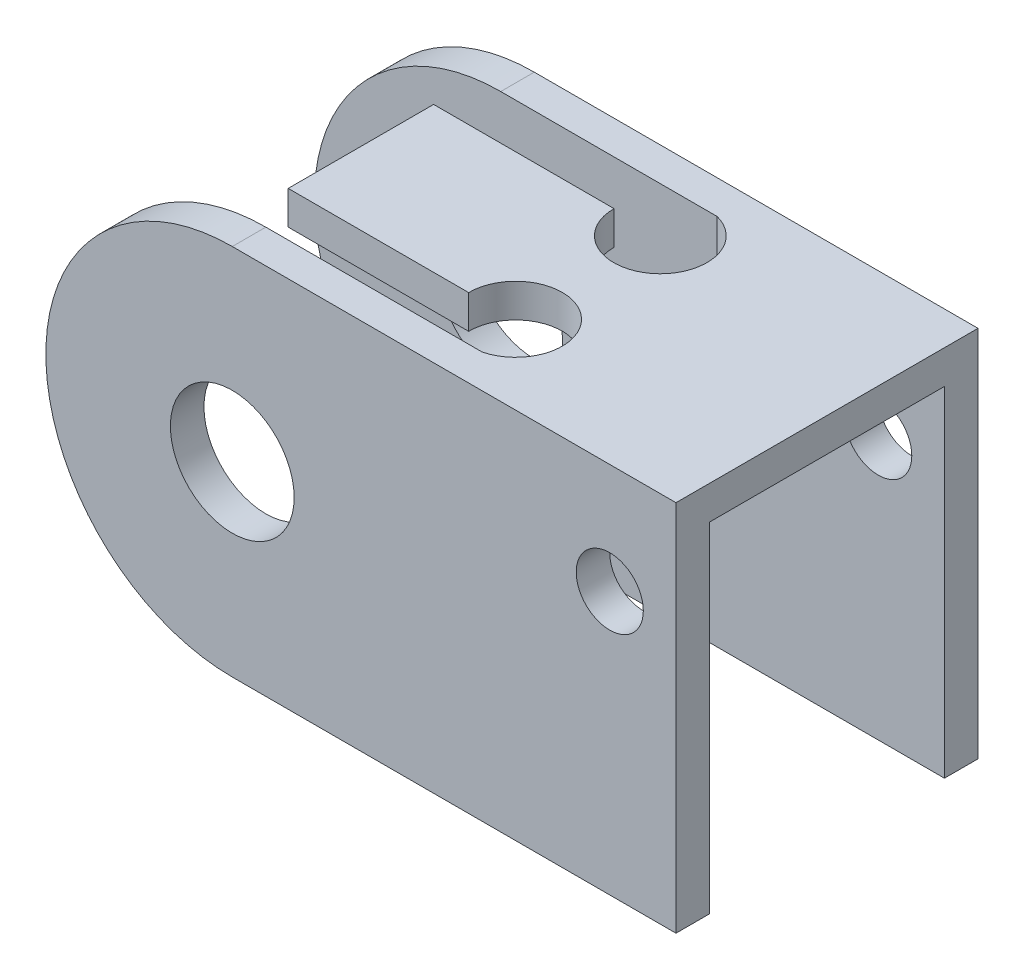
ISO-10303-21;
HEADER;
FILE_DESCRIPTION(('STEP AP214'),'2;1');
FILE_NAME('part.step','',(''),(''),'','','');
FILE_SCHEMA(('AUTOMOTIVE_DESIGN { 1 0 10303 214 1 1 1 1 }'));
ENDSEC;
DATA;
#1=APPLICATION_CONTEXT('core data for automotive mechanical design processes');
#2=APPLICATION_PROTOCOL_DEFINITION('international standard','automotive_design',2000,#1);
#3=PRODUCT_CONTEXT('',#1,'mechanical');
#4=PRODUCT('Part','Part','',(#3));
#5=PRODUCT_RELATED_PRODUCT_CATEGORY('part','',(#4));
#6=PRODUCT_DEFINITION_FORMATION('','',#4);
#7=PRODUCT_DEFINITION_CONTEXT('part definition',#1,'design');
#8=PRODUCT_DEFINITION('design','',#6,#7);
#9=PRODUCT_DEFINITION_SHAPE('','',#8);
#10=(LENGTH_UNIT() NAMED_UNIT(*) SI_UNIT(.MILLI.,.METRE.));
#11=(NAMED_UNIT(*) PLANE_ANGLE_UNIT() SI_UNIT($,.RADIAN.));
#12=(NAMED_UNIT(*) SI_UNIT($,.STERADIAN.) SOLID_ANGLE_UNIT());
#13=UNCERTAINTY_MEASURE_WITH_UNIT(LENGTH_MEASURE(1.E-05),#10,'distance_accuracy_value','');
#14=(GEOMETRIC_REPRESENTATION_CONTEXT(3) GLOBAL_UNCERTAINTY_ASSIGNED_CONTEXT((#13)) GLOBAL_UNIT_ASSIGNED_CONTEXT((#10,
#11,#12)) REPRESENTATION_CONTEXT('',''));
#15=CARTESIAN_POINT('',(0.,0.,0.));
#16=DIRECTION('',(0.,0.,1.));
#17=DIRECTION('',(1.,0.,0.));
#18=AXIS2_PLACEMENT_3D('',#15,#16,#17);
#19=CARTESIAN_POINT('',(-11.0363,-5.207,-5.1435));
#20=DIRECTION('',(0.,0.,-1.));
#21=DIRECTION('',(-1.,0.,0.));
#22=AXIS2_PLACEMENT_3D('',#19,#20,#21);
#23=CYLINDRICAL_SURFACE('',#22,6.35);
#24=DIRECTION('',(0.,0.,1.));
#25=VECTOR('',#24,1.);
#26=CARTESIAN_POINT('',(-11.0363,1.143,-5.1435));
#27=LINE('',#26,#25);
#28=CARTESIAN_POINT('',(-11.0363,1.143,-5.1435));
#29=VERTEX_POINT('',#28);
#30=CARTESIAN_POINT('',(-11.0363,1.143,-4.0005));
#31=VERTEX_POINT('',#30);
#32=EDGE_CURVE('E257',#29,#31,#27,.T.);
#33=ORIENTED_EDGE('',*,*,#32,.F.);
#34=CARTESIAN_POINT('',(-11.0363,-5.207,-5.1435));
#35=DIRECTION('',(0.,0.,1.));
#36=DIRECTION('',(1.,0.,0.));
#37=AXIS2_PLACEMENT_3D('',#34,#35,#36);
#38=CIRCLE('',#37,6.35);
#39=CARTESIAN_POINT('',(-11.0363,-11.557,-5.1435));
#40=VERTEX_POINT('',#39);
#41=EDGE_CURVE('E45',#40,#29,#38,.F.);
#42=ORIENTED_EDGE('',*,*,#41,.F.);
#43=DIRECTION('',(0.,0.,-1.));
#44=VECTOR('',#43,1.);
#45=CARTESIAN_POINT('',(-11.0363,-11.557,-4.0005));
#46=LINE('',#45,#44);
#47=CARTESIAN_POINT('',(-11.0363,-11.557,-4.0005));
#48=VERTEX_POINT('',#47);
#49=EDGE_CURVE('E260',#48,#40,#46,.T.);
#50=ORIENTED_EDGE('',*,*,#49,.F.);
#51=CARTESIAN_POINT('',(-11.0363,-5.207,-4.0005));
#52=DIRECTION('',(0.,0.,1.));
#53=DIRECTION('',(1.,0.,0.));
#54=AXIS2_PLACEMENT_3D('',#51,#52,#53);
#55=CIRCLE('',#54,6.35);
#56=EDGE_CURVE('E11',#31,#48,#55,.T.);
#57=ORIENTED_EDGE('',*,*,#56,.F.);
#58=EDGE_LOOP('',(#33,#42,#50,#57));
#59=FACE_BOUND('',#58,.T.);
#60=ADVANCED_FACE('F37',(#59),#23,.T.);
#61=CARTESIAN_POINT('',(-11.0363,-5.207,4.0005));
#62=DIRECTION('',(0.,0.,1.));
#63=DIRECTION('',(1.,0.,0.));
#64=AXIS2_PLACEMENT_3D('',#61,#62,#63);
#65=CYLINDRICAL_SURFACE('',#64,6.35);
#66=DIRECTION('',(0.,0.,1.));
#67=VECTOR('',#66,1.);
#68=CARTESIAN_POINT('',(-11.0363,1.143,0.));
#69=LINE('',#68,#67);
#70=CARTESIAN_POINT('',(-11.0363,1.143,4.0005));
#71=VERTEX_POINT('',#70);
#72=CARTESIAN_POINT('',(-11.0363,1.143,5.1435));
#73=VERTEX_POINT('',#72);
#74=EDGE_CURVE('E242',#71,#73,#69,.T.);
#75=ORIENTED_EDGE('',*,*,#74,.F.);
#76=CARTESIAN_POINT('',(-11.0363,-5.207,4.0005));
#77=DIRECTION('',(0.,0.,-1.));
#78=DIRECTION('',(-1.,0.,0.));
#79=AXIS2_PLACEMENT_3D('',#76,#77,#78);
#80=CIRCLE('',#79,6.35);
#81=CARTESIAN_POINT('',(-11.0363,-11.557,4.0005));
#82=VERTEX_POINT('',#81);
#83=EDGE_CURVE('E248',#82,#71,#80,.T.);
#84=ORIENTED_EDGE('',*,*,#83,.F.);
#85=DIRECTION('',(0.,0.,1.));
#86=VECTOR('',#85,1.);
#87=CARTESIAN_POINT('',(-11.0363,-11.557,4.0005));
#88=LINE('',#87,#86);
#89=CARTESIAN_POINT('',(-11.0363,-11.557,5.1435));
#90=VERTEX_POINT('',#89);
#91=EDGE_CURVE('E245',#90,#82,#88,.F.);
#92=ORIENTED_EDGE('',*,*,#91,.F.);
#93=CARTESIAN_POINT('',(-11.0363,-5.207,5.1435));
#94=DIRECTION('',(0.,0.,-1.));
#95=DIRECTION('',(-1.,0.,0.));
#96=AXIS2_PLACEMENT_3D('',#93,#94,#95);
#97=CIRCLE('',#96,6.35);
#98=EDGE_CURVE('E250',#73,#90,#97,.F.);
#99=ORIENTED_EDGE('',*,*,#98,.F.);
#100=EDGE_LOOP('',(#75,#84,#92,#99));
#101=FACE_BOUND('',#100,.T.);
#102=ADVANCED_FACE('F315',(#101),#65,.T.);
#103=CARTESIAN_POINT('',(4.0767,1.143,-5.1435));
#104=DIRECTION('',(-1.,0.,0.));
#105=DIRECTION('',(0.,0.,1.));
#106=AXIS2_PLACEMENT_3D('',#103,#104,#105);
#107=PLANE('',#106);
#108=DIRECTION('',(0.,0.,-1.));
#109=VECTOR('',#108,1.);
#110=CARTESIAN_POINT('',(4.0767,0.,-5.1435));
#111=LINE('',#110,#109);
#112=CARTESIAN_POINT('',(4.0767,0.,4.0005));
#113=VERTEX_POINT('',#112);
#114=CARTESIAN_POINT('',(4.0767,0.,-4.0005));
#115=VERTEX_POINT('',#114);
#116=EDGE_CURVE('E156',#113,#115,#111,.T.);
#117=ORIENTED_EDGE('',*,*,#116,.T.);
#118=DIRECTION('',(0.,1.,0.));
#119=VECTOR('',#118,1.);
#120=CARTESIAN_POINT('',(4.0767,1.143,-4.0005));
#121=LINE('',#120,#119);
#122=CARTESIAN_POINT('',(4.0767,-11.557,-4.0005));
#123=VERTEX_POINT('',#122);
#124=EDGE_CURVE('E137',#123,#115,#121,.T.);
#125=ORIENTED_EDGE('',*,*,#124,.F.);
#126=DIRECTION('',(0.,0.,-1.));
#127=VECTOR('',#126,1.);
#128=CARTESIAN_POINT('',(4.0767,-11.557,-4.0005));
#129=LINE('',#128,#127);
#130=CARTESIAN_POINT('',(4.0767,-11.557,-5.1435));
#131=VERTEX_POINT('',#130);
#132=EDGE_CURVE('E143',#123,#131,#129,.T.);
#133=ORIENTED_EDGE('',*,*,#132,.T.);
#134=DIRECTION('',(0.,-1.,0.));
#135=VECTOR('',#134,1.);
#136=CARTESIAN_POINT('',(4.0767,1.143,-5.1435));
#137=LINE('',#136,#135);
#138=CARTESIAN_POINT('',(4.0767,1.143,-5.1435));
#139=VERTEX_POINT('',#138);
#140=EDGE_CURVE('E237',#139,#131,#137,.T.);
#141=ORIENTED_EDGE('',*,*,#140,.F.);
#142=DIRECTION('',(0.,0.,-1.));
#143=VECTOR('',#142,1.);
#144=CARTESIAN_POINT('',(4.0767,1.143,-5.1435));
#145=LINE('',#144,#143);
#146=CARTESIAN_POINT('',(4.0767,1.143,5.1435));
#147=VERTEX_POINT('',#146);
#148=EDGE_CURVE('E226',#147,#139,#145,.T.);
#149=ORIENTED_EDGE('',*,*,#148,.F.);
#150=DIRECTION('',(0.,-1.,0.));
#151=VECTOR('',#150,1.);
#152=CARTESIAN_POINT('',(4.0767,1.143,5.1435));
#153=LINE('',#152,#151);
#154=CARTESIAN_POINT('',(4.0767,-11.557,5.1435));
#155=VERTEX_POINT('',#154);
#156=EDGE_CURVE('E233',#147,#155,#153,.T.);
#157=ORIENTED_EDGE('',*,*,#156,.T.);
#158=DIRECTION('',(0.,0.,1.));
#159=VECTOR('',#158,1.);
#160=CARTESIAN_POINT('',(4.0767,-11.557,4.0005));
#161=LINE('',#160,#159);
#162=CARTESIAN_POINT('',(4.0767,-11.557,4.0005));
#163=VERTEX_POINT('',#162);
#164=EDGE_CURVE('E183',#163,#155,#161,.T.);
#165=ORIENTED_EDGE('',*,*,#164,.F.);
#166=DIRECTION('',(0.,1.,0.));
#167=VECTOR('',#166,1.);
#168=CARTESIAN_POINT('',(4.0767,1.143,4.0005));
#169=LINE('',#168,#167);
#170=EDGE_CURVE('E175',#163,#113,#169,.T.);
#171=ORIENTED_EDGE('',*,*,#170,.T.);
#172=EDGE_LOOP('',(#117,#125,#133,#141,#149,#157,#165,#171));
#173=FACE_BOUND('',#172,.T.);
#174=ADVANCED_FACE('F153',(#173),#107,.F.);
#175=CARTESIAN_POINT('',(-4.0767,1.143,-5.1435));
#176=DIRECTION('',(0.,0.,1.));
#177=DIRECTION('',(1.,0.,0.));
#178=AXIS2_PLACEMENT_3D('',#175,#176,#177);
#179=PLANE('',#178);
#180=CARTESIAN_POINT('',(1.82121981781893,-2.60202754234179,-5.1435));
#181=DIRECTION('',(0.,0.,1.));
#182=DIRECTION('',(1.,0.,0.));
#183=AXIS2_PLACEMENT_3D('',#180,#181,#182);
#184=CIRCLE('',#183,1.143);
#185=CARTESIAN_POINT('',(2.96421981781893,-2.60202754234179,-5.1435));
#186=VERTEX_POINT('',#185);
#187=EDGE_CURVE('E379',#186,#186,#184,.T.);
#188=ORIENTED_EDGE('',*,*,#187,.T.);
#189=EDGE_LOOP('',(#188));
#190=FACE_BOUND('',#189,.T.);
#191=CARTESIAN_POINT('',(-11.0363,-5.207,-5.1435));
#192=DIRECTION('',(0.,0.,-1.));
#193=DIRECTION('',(-1.,0.,0.));
#194=AXIS2_PLACEMENT_3D('',#191,#192,#193);
#195=CIRCLE('',#194,2.1082);
#196=CARTESIAN_POINT('',(-13.1445,-5.207,-5.1435));
#197=VERTEX_POINT('',#196);
#198=EDGE_CURVE('E381',#197,#197,#195,.T.);
#199=ORIENTED_EDGE('',*,*,#198,.F.);
#200=EDGE_LOOP('',(#199));
#201=FACE_BOUND('',#200,.T.);
#202=DIRECTION('',(1.,0.,0.));
#203=VECTOR('',#202,1.);
#204=CARTESIAN_POINT('',(4.0767,-11.557,-5.1435));
#205=LINE('',#204,#203);
#206=EDGE_CURVE('E146',#40,#131,#205,.T.);
#207=ORIENTED_EDGE('',*,*,#206,.F.);
#208=ORIENTED_EDGE('',*,*,#41,.T.);
#209=DIRECTION('',(-1.,0.,0.));
#210=VECTOR('',#209,1.);
#211=CARTESIAN_POINT('',(-4.0767,1.143,-5.1435));
#212=LINE('',#211,#210);
#213=EDGE_CURVE('E228',#139,#29,#212,.T.);
#214=ORIENTED_EDGE('',*,*,#213,.F.);
#215=ORIENTED_EDGE('',*,*,#140,.T.);
#216=EDGE_LOOP('',(#207,#208,#214,#215));
#217=FACE_BOUND('',#216,.T.);
#218=ADVANCED_FACE('F263',(#190,#201,#217),#179,.F.);
#219=CARTESIAN_POINT('',(-4.0767,1.143,5.1435));
#220=DIRECTION('',(0.,0.,-1.));
#221=DIRECTION('',(-1.,0.,0.));
#222=AXIS2_PLACEMENT_3D('',#219,#220,#221);
#223=PLANE('',#222);
#224=CARTESIAN_POINT('',(1.82121981781893,-2.60202754234179,5.1435));
#225=DIRECTION('',(0.,0.,1.));
#226=DIRECTION('',(1.,0.,0.));
#227=AXIS2_PLACEMENT_3D('',#224,#225,#226);
#228=CIRCLE('',#227,1.143);
#229=CARTESIAN_POINT('',(2.96421981781893,-2.60202754234179,5.1435));
#230=VERTEX_POINT('',#229);
#231=EDGE_CURVE('E165',#230,#230,#228,.T.);
#232=ORIENTED_EDGE('',*,*,#231,.F.);
#233=EDGE_LOOP('',(#232));
#234=FACE_BOUND('',#233,.T.);
#235=CARTESIAN_POINT('',(-11.0363,-5.207,5.1435));
#236=DIRECTION('',(0.,0.,1.));
#237=DIRECTION('',(1.,0.,0.));
#238=AXIS2_PLACEMENT_3D('',#235,#236,#237);
#239=CIRCLE('',#238,2.1082);
#240=CARTESIAN_POINT('',(-8.9281,-5.207,5.1435));
#241=VERTEX_POINT('',#240);
#242=EDGE_CURVE('E169',#241,#241,#239,.T.);
#243=ORIENTED_EDGE('',*,*,#242,.F.);
#244=EDGE_LOOP('',(#243));
#245=FACE_BOUND('',#244,.T.);
#246=DIRECTION('',(1.,0.,0.));
#247=VECTOR('',#246,1.);
#248=CARTESIAN_POINT('',(-4.0767,1.143,5.1435));
#249=LINE('',#248,#247);
#250=EDGE_CURVE('E231',#73,#147,#249,.T.);
#251=ORIENTED_EDGE('',*,*,#250,.F.);
#252=ORIENTED_EDGE('',*,*,#98,.T.);
#253=DIRECTION('',(1.,0.,0.));
#254=VECTOR('',#253,1.);
#255=CARTESIAN_POINT('',(4.0767,-11.557,5.1435));
#256=LINE('',#255,#254);
#257=EDGE_CURVE('E178',#90,#155,#256,.T.);
#258=ORIENTED_EDGE('',*,*,#257,.T.);
#259=ORIENTED_EDGE('',*,*,#156,.F.);
#260=EDGE_LOOP('',(#251,#252,#258,#259));
#261=FACE_BOUND('',#260,.T.);
#262=ADVANCED_FACE('F330',(#234,#245,#261),#223,.F.);
#263=CARTESIAN_POINT('',(0.,1.143,0.));
#264=DIRECTION('',(0.,1.,0.));
#265=DIRECTION('',(0.,0.,1.));
#266=AXIS2_PLACEMENT_3D('',#263,#264,#265);
#267=PLANE('',#266);
#268=ORIENTED_EDGE('',*,*,#213,.T.);
#269=ORIENTED_EDGE('',*,*,#32,.T.);
#270=DIRECTION('',(-1.,0.,0.));
#271=VECTOR('',#270,1.);
#272=CARTESIAN_POINT('',(4.0767,1.143,-4.0005));
#273=LINE('',#272,#271);
#274=CARTESIAN_POINT('',(-3.66547261184954,1.143,-4.0005));
#275=VERTEX_POINT('',#274);
#276=EDGE_CURVE('E140',#275,#31,#273,.T.);
#277=ORIENTED_EDGE('',*,*,#276,.F.);
#278=CARTESIAN_POINT('',(-4.0640503984127,1.143,-2.4638503984127));
#279=DIRECTION('',(0.,-1.,0.));
#280=DIRECTION('',(0.,0.,1.));
#281=AXIS2_PLACEMENT_3D('',#278,#279,#280);
#282=CIRCLE('',#281,1.5875);
#283=CARTESIAN_POINT('',(-5.6515,1.143,-2.4765));
#284=VERTEX_POINT('',#283);
#285=EDGE_CURVE('E200',#275,#284,#282,.T.);
#286=ORIENTED_EDGE('',*,*,#285,.T.);
#287=DIRECTION('',(-1.,0.,0.));
#288=VECTOR('',#287,1.);
#289=CARTESIAN_POINT('',(-11.7983,1.143,-2.4765));
#290=LINE('',#289,#288);
#291=CARTESIAN_POINT('',(-11.7983,1.143,-2.4765));
#292=VERTEX_POINT('',#291);
#293=EDGE_CURVE('E202',#284,#292,#290,.T.);
#294=ORIENTED_EDGE('',*,*,#293,.T.);
#295=DIRECTION('',(0.,0.,1.));
#296=VECTOR('',#295,1.);
#297=CARTESIAN_POINT('',(-11.7983,1.143,-2.4765));
#298=LINE('',#297,#296);
#299=CARTESIAN_POINT('',(-11.7983,1.143,2.4765));
#300=VERTEX_POINT('',#299);
#301=EDGE_CURVE('E191',#292,#300,#298,.T.);
#302=ORIENTED_EDGE('',*,*,#301,.T.);
#303=DIRECTION('',(1.,0.,0.));
#304=VECTOR('',#303,1.);
#305=CARTESIAN_POINT('',(-11.7983,1.143,2.4765));
#306=LINE('',#305,#304);
#307=CARTESIAN_POINT('',(-5.6515,1.143,2.4765));
#308=VERTEX_POINT('',#307);
#309=EDGE_CURVE('E194',#300,#308,#306,.T.);
#310=ORIENTED_EDGE('',*,*,#309,.T.);
#311=CARTESIAN_POINT('',(-4.06405039841269,1.143,2.4638503984127));
#312=DIRECTION('',(0.,-1.,0.));
#313=DIRECTION('',(0.,0.,1.));
#314=AXIS2_PLACEMENT_3D('',#311,#312,#313);
#315=CIRCLE('',#314,1.5875);
#316=CARTESIAN_POINT('',(-3.66547261184953,1.143,4.0005));
#317=VERTEX_POINT('',#316);
#318=EDGE_CURVE('E197',#308,#317,#315,.T.);
#319=ORIENTED_EDGE('',*,*,#318,.T.);
#320=DIRECTION('',(-1.,0.,0.));
#321=VECTOR('',#320,1.);
#322=CARTESIAN_POINT('',(4.0767,1.143,4.0005));
#323=LINE('',#322,#321);
#324=EDGE_CURVE('E177',#317,#71,#323,.T.);
#325=ORIENTED_EDGE('',*,*,#324,.T.);
#326=ORIENTED_EDGE('',*,*,#74,.T.);
#327=ORIENTED_EDGE('',*,*,#250,.T.);
#328=ORIENTED_EDGE('',*,*,#148,.T.);
#329=EDGE_LOOP('',(#268,#269,#277,#286,#294,#302,#310,#319,#325,#326,#327,#328));
#330=FACE_BOUND('',#329,.T.);
#331=ADVANCED_FACE('F266',(#330),#267,.T.);
#332=CARTESIAN_POINT('',(0.,0.,0.));
#333=DIRECTION('',(0.,1.,0.));
#334=DIRECTION('',(0.,0.,1.));
#335=AXIS2_PLACEMENT_3D('',#332,#333,#334);
#336=PLANE('',#335);
#337=CARTESIAN_POINT('',(-4.0640503984127,0.,-2.4638503984127));
#338=DIRECTION('',(0.,-1.,0.));
#339=DIRECTION('',(0.,0.,1.));
#340=AXIS2_PLACEMENT_3D('',#337,#338,#339);
#341=CIRCLE('',#340,1.5875);
#342=CARTESIAN_POINT('',(-3.66547261184954,0.,-4.0005));
#343=VERTEX_POINT('',#342);
#344=CARTESIAN_POINT('',(-5.6515,0.,-2.4765));
#345=VERTEX_POINT('',#344);
#346=EDGE_CURVE('E212',#343,#345,#341,.T.);
#347=ORIENTED_EDGE('',*,*,#346,.F.);
#348=DIRECTION('',(1.,0.,0.));
#349=VECTOR('',#348,1.);
#350=CARTESIAN_POINT('',(0.,0.,-4.0005));
#351=LINE('',#350,#349);
#352=EDGE_CURVE('E150',#343,#115,#351,.T.);
#353=ORIENTED_EDGE('',*,*,#352,.T.);
#354=ORIENTED_EDGE('',*,*,#116,.F.);
#355=DIRECTION('',(-1.,0.,0.));
#356=VECTOR('',#355,1.);
#357=CARTESIAN_POINT('',(0.,0.,4.0005));
#358=LINE('',#357,#356);
#359=CARTESIAN_POINT('',(-3.66547261184953,0.,4.0005));
#360=VERTEX_POINT('',#359);
#361=EDGE_CURVE('E187',#113,#360,#358,.T.);
#362=ORIENTED_EDGE('',*,*,#361,.T.);
#363=CARTESIAN_POINT('',(-4.06405039841269,0.,2.4638503984127));
#364=DIRECTION('',(0.,-1.,0.));
#365=DIRECTION('',(0.,0.,1.));
#366=AXIS2_PLACEMENT_3D('',#363,#364,#365);
#367=CIRCLE('',#366,1.5875);
#368=CARTESIAN_POINT('',(-5.6515,0.,2.4765));
#369=VERTEX_POINT('',#368);
#370=EDGE_CURVE('E209',#369,#360,#367,.T.);
#371=ORIENTED_EDGE('',*,*,#370,.F.);
#372=DIRECTION('',(1.,0.,0.));
#373=VECTOR('',#372,1.);
#374=CARTESIAN_POINT('',(-11.7983,0.,2.4765));
#375=LINE('',#374,#373);
#376=CARTESIAN_POINT('',(-11.7983,0.,2.4765));
#377=VERTEX_POINT('',#376);
#378=EDGE_CURVE('E207',#377,#369,#375,.T.);
#379=ORIENTED_EDGE('',*,*,#378,.F.);
#380=DIRECTION('',(0.,0.,1.));
#381=VECTOR('',#380,1.);
#382=CARTESIAN_POINT('',(-11.7983,0.,-2.4765));
#383=LINE('',#382,#381);
#384=CARTESIAN_POINT('',(-11.7983,0.,-2.4765));
#385=VERTEX_POINT('',#384);
#386=EDGE_CURVE('E190',#385,#377,#383,.T.);
#387=ORIENTED_EDGE('',*,*,#386,.F.);
#388=DIRECTION('',(-1.,0.,0.));
#389=VECTOR('',#388,1.);
#390=CARTESIAN_POINT('',(-11.7983,0.,-2.4765));
#391=LINE('',#390,#389);
#392=EDGE_CURVE('E195',#345,#385,#391,.T.);
#393=ORIENTED_EDGE('',*,*,#392,.F.);
#394=EDGE_LOOP('',(#347,#353,#354,#362,#371,#379,#387,#393));
#395=FACE_BOUND('',#394,.T.);
#396=ADVANCED_FACE('F283',(#395),#336,.F.);
#397=CARTESIAN_POINT('',(-4.06405039841269,1.143,2.4638503984127));
#398=DIRECTION('',(0.,-1.,0.));
#399=DIRECTION('',(0.,0.,-1.));
#400=AXIS2_PLACEMENT_3D('',#397,#398,#399);
#401=CYLINDRICAL_SURFACE('',#400,1.5875);
#402=ORIENTED_EDGE('',*,*,#370,.T.);
#403=DIRECTION('',(0.,-1.,0.));
#404=VECTOR('',#403,1.);
#405=CARTESIAN_POINT('',(-3.66547261184953,1.143,4.0005));
#406=LINE('',#405,#404);
#407=EDGE_CURVE('E239',#360,#317,#406,.F.);
#408=ORIENTED_EDGE('',*,*,#407,.T.);
#409=ORIENTED_EDGE('',*,*,#318,.F.);
#410=DIRECTION('',(0.,-1.,0.));
#411=VECTOR('',#410,1.);
#412=CARTESIAN_POINT('',(-5.6515,1.143,2.4765));
#413=LINE('',#412,#411);
#414=EDGE_CURVE('E220',#308,#369,#413,.T.);
#415=ORIENTED_EDGE('',*,*,#414,.T.);
#416=EDGE_LOOP('',(#402,#408,#409,#415));
#417=FACE_BOUND('',#416,.T.);
#418=ADVANCED_FACE('F304',(#417),#401,.F.);
#419=CARTESIAN_POINT('',(-4.0640503984127,1.143,-2.4638503984127));
#420=DIRECTION('',(0.,-1.,0.));
#421=DIRECTION('',(0.,0.,-1.));
#422=AXIS2_PLACEMENT_3D('',#419,#420,#421);
#423=CYLINDRICAL_SURFACE('',#422,1.5875);
#424=ORIENTED_EDGE('',*,*,#285,.F.);
#425=DIRECTION('',(0.,-1.,0.));
#426=VECTOR('',#425,1.);
#427=CARTESIAN_POINT('',(-3.66547261184954,1.143,-4.0005));
#428=LINE('',#427,#426);
#429=EDGE_CURVE('E252',#275,#343,#428,.T.);
#430=ORIENTED_EDGE('',*,*,#429,.T.);
#431=ORIENTED_EDGE('',*,*,#346,.T.);
#432=DIRECTION('',(0.,-1.,0.));
#433=VECTOR('',#432,1.);
#434=CARTESIAN_POINT('',(-5.6515,1.143,-2.4765));
#435=LINE('',#434,#433);
#436=EDGE_CURVE('E217',#284,#345,#435,.T.);
#437=ORIENTED_EDGE('',*,*,#436,.F.);
#438=EDGE_LOOP('',(#424,#430,#431,#437));
#439=FACE_BOUND('',#438,.T.);
#440=ADVANCED_FACE('F288',(#439),#423,.F.);
#441=CARTESIAN_POINT('',(-11.7983,1.143,-2.4765));
#442=DIRECTION('',(1.,0.,0.));
#443=DIRECTION('',(0.,0.,-1.));
#444=AXIS2_PLACEMENT_3D('',#441,#442,#443);
#445=PLANE('',#444);
#446=ORIENTED_EDGE('',*,*,#386,.T.);
#447=DIRECTION('',(0.,-1.,0.));
#448=VECTOR('',#447,1.);
#449=CARTESIAN_POINT('',(-11.7983,1.143,2.4765));
#450=LINE('',#449,#448);
#451=EDGE_CURVE('E223',#300,#377,#450,.T.);
#452=ORIENTED_EDGE('',*,*,#451,.F.);
#453=ORIENTED_EDGE('',*,*,#301,.F.);
#454=DIRECTION('',(0.,-1.,0.));
#455=VECTOR('',#454,1.);
#456=CARTESIAN_POINT('',(-11.7983,1.143,-2.4765));
#457=LINE('',#456,#455);
#458=EDGE_CURVE('E204',#292,#385,#457,.T.);
#459=ORIENTED_EDGE('',*,*,#458,.T.);
#460=EDGE_LOOP('',(#446,#452,#453,#459));
#461=FACE_BOUND('',#460,.T.);
#462=ADVANCED_FACE('F298',(#461),#445,.F.);
#463=CARTESIAN_POINT('',(-11.7983,1.143,2.4765));
#464=DIRECTION('',(0.,0.,-1.));
#465=DIRECTION('',(-1.,0.,0.));
#466=AXIS2_PLACEMENT_3D('',#463,#464,#465);
#467=PLANE('',#466);
#468=ORIENTED_EDGE('',*,*,#378,.T.);
#469=ORIENTED_EDGE('',*,*,#414,.F.);
#470=ORIENTED_EDGE('',*,*,#309,.F.);
#471=ORIENTED_EDGE('',*,*,#451,.T.);
#472=EDGE_LOOP('',(#468,#469,#470,#471));
#473=FACE_BOUND('',#472,.T.);
#474=ADVANCED_FACE('F300',(#473),#467,.F.);
#475=CARTESIAN_POINT('',(-11.7983,1.143,-2.4765));
#476=DIRECTION('',(0.,0.,1.));
#477=DIRECTION('',(1.,0.,0.));
#478=AXIS2_PLACEMENT_3D('',#475,#476,#477);
#479=PLANE('',#478);
#480=ORIENTED_EDGE('',*,*,#392,.T.);
#481=ORIENTED_EDGE('',*,*,#458,.F.);
#482=ORIENTED_EDGE('',*,*,#293,.F.);
#483=ORIENTED_EDGE('',*,*,#436,.T.);
#484=EDGE_LOOP('',(#480,#481,#482,#483));
#485=FACE_BOUND('',#484,.T.);
#486=ADVANCED_FACE('F295',(#485),#479,.F.);
#487=CARTESIAN_POINT('',(0.,0.,4.0005));
#488=DIRECTION('',(0.,0.,-1.));
#489=DIRECTION('',(-1.,0.,0.));
#490=AXIS2_PLACEMENT_3D('',#487,#488,#489);
#491=PLANE('',#490);
#492=CARTESIAN_POINT('',(1.82121981781893,-2.60202754234179,4.0005));
#493=DIRECTION('',(0.,0.,1.));
#494=DIRECTION('',(1.,0.,0.));
#495=AXIS2_PLACEMENT_3D('',#492,#493,#494);
#496=CIRCLE('',#495,1.143);
#497=CARTESIAN_POINT('',(2.96421981781893,-2.60202754234179,4.0005));
#498=VERTEX_POINT('',#497);
#499=EDGE_CURVE('E166',#498,#498,#496,.T.);
#500=ORIENTED_EDGE('',*,*,#499,.T.);
#501=EDGE_LOOP('',(#500));
#502=FACE_BOUND('',#501,.T.);
#503=CARTESIAN_POINT('',(-11.0363,-5.207,4.0005));
#504=DIRECTION('',(0.,0.,-1.));
#505=DIRECTION('',(-1.,0.,0.));
#506=AXIS2_PLACEMENT_3D('',#503,#504,#505);
#507=CIRCLE('',#506,2.1082);
#508=CARTESIAN_POINT('',(-13.1445,-5.207,4.0005));
#509=VERTEX_POINT('',#508);
#510=EDGE_CURVE('E174',#509,#509,#507,.T.);
#511=ORIENTED_EDGE('',*,*,#510,.F.);
#512=EDGE_LOOP('',(#511));
#513=FACE_BOUND('',#512,.T.);
#514=DIRECTION('',(1.,0.,0.));
#515=VECTOR('',#514,1.);
#516=CARTESIAN_POINT('',(4.0767,-11.557,4.0005));
#517=LINE('',#516,#515);
#518=EDGE_CURVE('E181',#82,#163,#517,.T.);
#519=ORIENTED_EDGE('',*,*,#518,.F.);
#520=ORIENTED_EDGE('',*,*,#83,.T.);
#521=ORIENTED_EDGE('',*,*,#324,.F.);
#522=ORIENTED_EDGE('',*,*,#407,.F.);
#523=ORIENTED_EDGE('',*,*,#361,.F.);
#524=ORIENTED_EDGE('',*,*,#170,.F.);
#525=EDGE_LOOP('',(#519,#520,#521,#522,#523,#524));
#526=FACE_BOUND('',#525,.T.);
#527=ADVANCED_FACE('F279',(#502,#513,#526),#491,.T.);
#528=CARTESIAN_POINT('',(4.0767,-11.557,4.0005));
#529=DIRECTION('',(0.,-1.,0.));
#530=DIRECTION('',(1.,0.,0.));
#531=AXIS2_PLACEMENT_3D('',#528,#529,#530);
#532=PLANE('',#531);
#533=ORIENTED_EDGE('',*,*,#257,.F.);
#534=ORIENTED_EDGE('',*,*,#91,.T.);
#535=ORIENTED_EDGE('',*,*,#518,.T.);
#536=ORIENTED_EDGE('',*,*,#164,.T.);
#537=EDGE_LOOP('',(#533,#534,#535,#536));
#538=FACE_BOUND('',#537,.T.);
#539=ADVANCED_FACE('F275',(#538),#532,.T.);
#540=CARTESIAN_POINT('',(-11.0363,-5.207,5.1435));
#541=DIRECTION('',(0.,0.,1.));
#542=DIRECTION('',(1.,0.,0.));
#543=AXIS2_PLACEMENT_3D('',#540,#541,#542);
#544=CYLINDRICAL_SURFACE('',#543,2.1082);
#545=ORIENTED_EDGE('',*,*,#510,.T.);
#546=EDGE_LOOP('',(#545));
#547=FACE_BOUND('',#546,.T.);
#548=ORIENTED_EDGE('',*,*,#242,.T.);
#549=EDGE_LOOP('',(#548));
#550=FACE_BOUND('',#549,.T.);
#551=ADVANCED_FACE('F350',(#547,#550),#544,.F.);
#552=CARTESIAN_POINT('',(1.82121981781893,-2.60202754234179,4.0005));
#553=DIRECTION('',(0.,0.,1.));
#554=DIRECTION('',(1.,0.,0.));
#555=AXIS2_PLACEMENT_3D('',#552,#553,#554);
#556=CYLINDRICAL_SURFACE('',#555,1.143);
#557=ORIENTED_EDGE('',*,*,#499,.F.);
#558=EDGE_LOOP('',(#557));
#559=FACE_BOUND('',#558,.T.);
#560=ORIENTED_EDGE('',*,*,#231,.T.);
#561=EDGE_LOOP('',(#560));
#562=FACE_BOUND('',#561,.T.);
#563=ADVANCED_FACE('F354',(#559,#562),#556,.F.);
#564=CARTESIAN_POINT('',(0.,0.,-4.0005));
#565=DIRECTION('',(0.,0.,1.));
#566=DIRECTION('',(-1.,0.,0.));
#567=AXIS2_PLACEMENT_3D('',#564,#565,#566);
#568=PLANE('',#567);
#569=CARTESIAN_POINT('',(1.82121981781893,-2.60202754234179,-4.0005));
#570=DIRECTION('',(0.,0.,1.));
#571=DIRECTION('',(1.,0.,0.));
#572=AXIS2_PLACEMENT_3D('',#569,#570,#571);
#573=CIRCLE('',#572,1.143);
#574=CARTESIAN_POINT('',(2.96421981781893,-2.60202754234179,-4.0005));
#575=VERTEX_POINT('',#574);
#576=EDGE_CURVE('E376',#575,#575,#573,.T.);
#577=ORIENTED_EDGE('',*,*,#576,.F.);
#578=EDGE_LOOP('',(#577));
#579=FACE_BOUND('',#578,.T.);
#580=CARTESIAN_POINT('',(-11.0363,-5.207,-4.0005));
#581=DIRECTION('',(0.,0.,1.));
#582=DIRECTION('',(1.,0.,0.));
#583=AXIS2_PLACEMENT_3D('',#580,#581,#582);
#584=CIRCLE('',#583,2.1082);
#585=CARTESIAN_POINT('',(-8.9281,-5.207,-4.0005));
#586=VERTEX_POINT('',#585);
#587=EDGE_CURVE('E158',#586,#586,#584,.T.);
#588=ORIENTED_EDGE('',*,*,#587,.F.);
#589=EDGE_LOOP('',(#588));
#590=FACE_BOUND('',#589,.T.);
#591=ORIENTED_EDGE('',*,*,#276,.T.);
#592=ORIENTED_EDGE('',*,*,#56,.T.);
#593=DIRECTION('',(1.,0.,0.));
#594=VECTOR('',#593,1.);
#595=CARTESIAN_POINT('',(4.0767,-11.557,-4.0005));
#596=LINE('',#595,#594);
#597=EDGE_CURVE('E133',#48,#123,#596,.T.);
#598=ORIENTED_EDGE('',*,*,#597,.T.);
#599=ORIENTED_EDGE('',*,*,#124,.T.);
#600=ORIENTED_EDGE('',*,*,#352,.F.);
#601=ORIENTED_EDGE('',*,*,#429,.F.);
#602=EDGE_LOOP('',(#591,#592,#598,#599,#600,#601));
#603=FACE_BOUND('',#602,.T.);
#604=ADVANCED_FACE('F135',(#579,#590,#603),#568,.T.);
#605=CARTESIAN_POINT('',(4.0767,-11.557,-4.0005));
#606=DIRECTION('',(0.,1.,0.));
#607=DIRECTION('',(-1.,0.,0.));
#608=AXIS2_PLACEMENT_3D('',#605,#606,#607);
#609=PLANE('',#608);
#610=ORIENTED_EDGE('',*,*,#597,.F.);
#611=ORIENTED_EDGE('',*,*,#49,.T.);
#612=ORIENTED_EDGE('',*,*,#206,.T.);
#613=ORIENTED_EDGE('',*,*,#132,.F.);
#614=EDGE_LOOP('',(#610,#611,#612,#613));
#615=FACE_BOUND('',#614,.T.);
#616=ADVANCED_FACE('F144',(#615),#609,.F.);
#617=CARTESIAN_POINT('',(-11.0363,-5.207,-5.1435));
#618=DIRECTION('',(0.,0.,-1.));
#619=DIRECTION('',(-1.,0.,0.));
#620=AXIS2_PLACEMENT_3D('',#617,#618,#619);
#621=CYLINDRICAL_SURFACE('',#620,2.1082);
#622=ORIENTED_EDGE('',*,*,#587,.T.);
#623=EDGE_LOOP('',(#622));
#624=FACE_BOUND('',#623,.T.);
#625=ORIENTED_EDGE('',*,*,#198,.T.);
#626=EDGE_LOOP('',(#625));
#627=FACE_BOUND('',#626,.T.);
#628=ADVANCED_FACE('F361',(#624,#627),#621,.F.);
#629=CARTESIAN_POINT('',(1.82121981781893,-2.60202754234179,-4.0005));
#630=DIRECTION('',(0.,0.,-1.));
#631=DIRECTION('',(-1.,0.,0.));
#632=AXIS2_PLACEMENT_3D('',#629,#630,#631);
#633=CYLINDRICAL_SURFACE('',#632,1.143);
#634=ORIENTED_EDGE('',*,*,#576,.T.);
#635=EDGE_LOOP('',(#634));
#636=FACE_BOUND('',#635,.T.);
#637=ORIENTED_EDGE('',*,*,#187,.F.);
#638=EDGE_LOOP('',(#637));
#639=FACE_BOUND('',#638,.T.);
#640=ADVANCED_FACE('F367',(#636,#639),#633,.F.);
#641=CLOSED_SHELL('',(#60,#102,#174,#218,#262,#331,#396,#418,#440,#462,#474,#486,#527,#539,#551,
#563,#604,#616,#628,#640));
#642=MANIFOLD_SOLID_BREP('B2',#641);
#643=ADVANCED_BREP_SHAPE_REPRESENTATION('',(#18,#642),#14);
#644=SHAPE_DEFINITION_REPRESENTATION(#9,#643);
ENDSEC;
END-ISO-10303-21;
